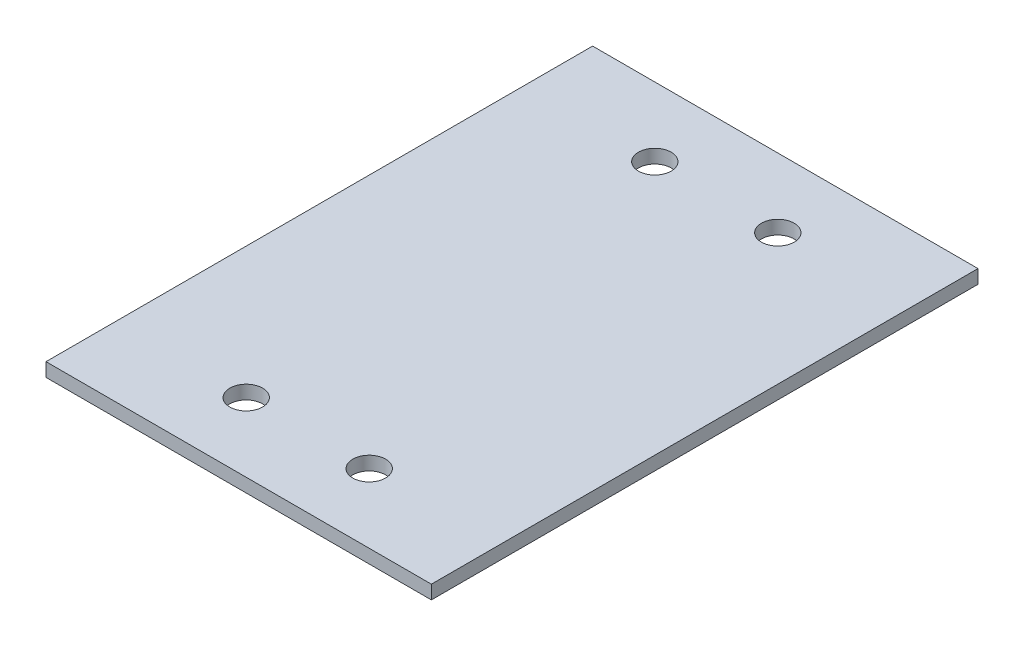
ISO-10303-21;
HEADER;
FILE_DESCRIPTION(('STEP AP214'),'2;1');
FILE_NAME('part.step','',(''),(''),'','','');
FILE_SCHEMA(('AUTOMOTIVE_DESIGN { 1 0 10303 214 1 1 1 1 }'));
ENDSEC;
DATA;
#1=APPLICATION_CONTEXT('core data for automotive mechanical design processes');
#2=APPLICATION_PROTOCOL_DEFINITION('international standard','automotive_design',2000,#1);
#3=PRODUCT_CONTEXT('',#1,'mechanical');
#4=PRODUCT('Part','Part','',(#3));
#5=PRODUCT_RELATED_PRODUCT_CATEGORY('part','',(#4));
#6=PRODUCT_DEFINITION_FORMATION('','',#4);
#7=PRODUCT_DEFINITION_CONTEXT('part definition',#1,'design');
#8=PRODUCT_DEFINITION('design','',#6,#7);
#9=PRODUCT_DEFINITION_SHAPE('','',#8);
#10=(LENGTH_UNIT() NAMED_UNIT(*) SI_UNIT(.MILLI.,.METRE.));
#11=(NAMED_UNIT(*) PLANE_ANGLE_UNIT() SI_UNIT($,.RADIAN.));
#12=(NAMED_UNIT(*) SI_UNIT($,.STERADIAN.) SOLID_ANGLE_UNIT());
#13=UNCERTAINTY_MEASURE_WITH_UNIT(LENGTH_MEASURE(1.E-05),#10,'distance_accuracy_value','');
#14=(GEOMETRIC_REPRESENTATION_CONTEXT(3) GLOBAL_UNCERTAINTY_ASSIGNED_CONTEXT((#13)) GLOBAL_UNIT_ASSIGNED_CONTEXT((#10,
#11,#12)) REPRESENTATION_CONTEXT('',''));
#15=CARTESIAN_POINT('',(0.,0.,0.));
#16=DIRECTION('',(0.,0.,1.));
#17=DIRECTION('',(1.,0.,0.));
#18=AXIS2_PLACEMENT_3D('',#15,#16,#17);
#19=CARTESIAN_POINT('',(0.,5.,0.));
#20=DIRECTION('',(0.,-1.,0.));
#21=DIRECTION('',(0.,0.,-1.));
#22=AXIS2_PLACEMENT_3D('',#19,#20,#21);
#23=PLANE('',#22);
#24=DIRECTION('',(0.,0.,-1.));
#25=VECTOR('',#24,1.);
#26=CARTESIAN_POINT('',(70.5,5.,100.));
#27=LINE('',#26,#25);
#28=CARTESIAN_POINT('',(70.5,5.,100.));
#29=VERTEX_POINT('',#28);
#30=CARTESIAN_POINT('',(70.5,5.,-100.));
#31=VERTEX_POINT('',#30);
#32=EDGE_CURVE('E85',#29,#31,#27,.T.);
#33=ORIENTED_EDGE('',*,*,#32,.T.);
#34=DIRECTION('',(-1.,0.,0.));
#35=VECTOR('',#34,1.);
#36=CARTESIAN_POINT('',(-70.5,5.,-100.));
#37=LINE('',#36,#35);
#38=CARTESIAN_POINT('',(-70.5,5.,-100.));
#39=VERTEX_POINT('',#38);
#40=EDGE_CURVE('E80',#31,#39,#37,.T.);
#41=ORIENTED_EDGE('',*,*,#40,.T.);
#42=DIRECTION('',(0.,0.,1.));
#43=VECTOR('',#42,1.);
#44=CARTESIAN_POINT('',(-70.5,5.,100.));
#45=LINE('',#44,#43);
#46=CARTESIAN_POINT('',(-70.5,5.,100.));
#47=VERTEX_POINT('',#46);
#48=EDGE_CURVE('E83',#39,#47,#45,.T.);
#49=ORIENTED_EDGE('',*,*,#48,.T.);
#50=DIRECTION('',(1.,0.,0.));
#51=VECTOR('',#50,1.);
#52=CARTESIAN_POINT('',(-70.5,5.,100.));
#53=LINE('',#52,#51);
#54=EDGE_CURVE('E50',#47,#29,#53,.T.);
#55=ORIENTED_EDGE('',*,*,#54,.T.);
#56=EDGE_LOOP('',(#33,#41,#49,#55));
#57=FACE_BOUND('',#56,.T.);
#58=CARTESIAN_POINT('',(-22.5,5.,-74.7500000000582));
#59=DIRECTION('',(0.,1.,0.));
#60=DIRECTION('',(0.,0.,1.));
#61=AXIS2_PLACEMENT_3D('',#58,#59,#60);
#62=CIRCLE('',#61,5.99999999999049);
#63=CARTESIAN_POINT('',(-22.5,5.,-68.7500000000677));
#64=VERTEX_POINT('',#63);
#65=EDGE_CURVE('E100',#64,#64,#62,.T.);
#66=ORIENTED_EDGE('',*,*,#65,.F.);
#67=EDGE_LOOP('',(#66));
#68=FACE_BOUND('',#67,.T.);
#69=CARTESIAN_POINT('',(22.5,5.,-74.7500000000582));
#70=DIRECTION('',(0.,1.,0.));
#71=DIRECTION('',(0.,0.,1.));
#72=AXIS2_PLACEMENT_3D('',#69,#70,#71);
#73=CIRCLE('',#72,5.99999999999391);
#74=CARTESIAN_POINT('',(22.5,5.,-68.7500000000643));
#75=VERTEX_POINT('',#74);
#76=EDGE_CURVE('E115',#75,#75,#73,.T.);
#77=ORIENTED_EDGE('',*,*,#76,.F.);
#78=EDGE_LOOP('',(#77));
#79=FACE_BOUND('',#78,.T.);
#80=CARTESIAN_POINT('',(-22.5,5.,74.7499999999418));
#81=DIRECTION('',(0.,1.,0.));
#82=DIRECTION('',(0.,0.,1.));
#83=AXIS2_PLACEMENT_3D('',#80,#81,#82);
#84=CIRCLE('',#83,6.);
#85=CARTESIAN_POINT('',(-22.5,5.,80.7499999999418));
#86=VERTEX_POINT('',#85);
#87=EDGE_CURVE('E121',#86,#86,#84,.T.);
#88=ORIENTED_EDGE('',*,*,#87,.F.);
#89=EDGE_LOOP('',(#88));
#90=FACE_BOUND('',#89,.T.);
#91=CARTESIAN_POINT('',(22.500000000004,5.,74.7499999999418));
#92=DIRECTION('',(0.,1.,0.));
#93=DIRECTION('',(0.,0.,1.));
#94=AXIS2_PLACEMENT_3D('',#91,#92,#93);
#95=CIRCLE('',#94,6.);
#96=CARTESIAN_POINT('',(22.500000000004,5.,80.7499999999418));
#97=VERTEX_POINT('',#96);
#98=EDGE_CURVE('E127',#97,#97,#95,.T.);
#99=ORIENTED_EDGE('',*,*,#98,.F.);
#100=EDGE_LOOP('',(#99));
#101=FACE_BOUND('',#100,.T.);
#102=ADVANCED_FACE('F33',(#57,#68,#79,#90,#101),#23,.F.);
#103=CARTESIAN_POINT('',(0.,0.,0.));
#104=DIRECTION('',(0.,-1.,0.));
#105=DIRECTION('',(0.,0.,-1.));
#106=AXIS2_PLACEMENT_3D('',#103,#104,#105);
#107=PLANE('',#106);
#108=CARTESIAN_POINT('',(-22.5,0.,74.7499999999418));
#109=DIRECTION('',(0.,1.,0.));
#110=DIRECTION('',(0.,0.,1.));
#111=AXIS2_PLACEMENT_3D('',#108,#109,#110);
#112=CIRCLE('',#111,6.);
#113=CARTESIAN_POINT('',(-22.5,0.,80.7499999999418));
#114=VERTEX_POINT('',#113);
#115=EDGE_CURVE('E124',#114,#114,#112,.T.);
#116=ORIENTED_EDGE('',*,*,#115,.T.);
#117=EDGE_LOOP('',(#116));
#118=FACE_BOUND('',#117,.T.);
#119=CARTESIAN_POINT('',(-22.5,0.,-74.7500000000582));
#120=DIRECTION('',(0.,1.,0.));
#121=DIRECTION('',(0.,0.,1.));
#122=AXIS2_PLACEMENT_3D('',#119,#120,#121);
#123=CIRCLE('',#122,5.99999999999049);
#124=CARTESIAN_POINT('',(-22.5,0.,-68.7500000000677));
#125=VERTEX_POINT('',#124);
#126=EDGE_CURVE('E112',#125,#125,#123,.T.);
#127=ORIENTED_EDGE('',*,*,#126,.T.);
#128=EDGE_LOOP('',(#127));
#129=FACE_BOUND('',#128,.T.);
#130=DIRECTION('',(0.,0.,-1.));
#131=VECTOR('',#130,1.);
#132=CARTESIAN_POINT('',(70.5,0.,100.));
#133=LINE('',#132,#131);
#134=CARTESIAN_POINT('',(70.5,0.,100.));
#135=VERTEX_POINT('',#134);
#136=CARTESIAN_POINT('',(70.5,0.,-100.));
#137=VERTEX_POINT('',#136);
#138=EDGE_CURVE('E97',#135,#137,#133,.T.);
#139=ORIENTED_EDGE('',*,*,#138,.F.);
#140=DIRECTION('',(1.,0.,0.));
#141=VECTOR('',#140,1.);
#142=CARTESIAN_POINT('',(-70.5,0.,100.));
#143=LINE('',#142,#141);
#144=CARTESIAN_POINT('',(-70.5,0.,100.));
#145=VERTEX_POINT('',#144);
#146=EDGE_CURVE('E73',#145,#135,#143,.T.);
#147=ORIENTED_EDGE('',*,*,#146,.F.);
#148=DIRECTION('',(0.,0.,1.));
#149=VECTOR('',#148,1.);
#150=CARTESIAN_POINT('',(-70.5,0.,100.));
#151=LINE('',#150,#149);
#152=CARTESIAN_POINT('',(-70.5,0.,-100.));
#153=VERTEX_POINT('',#152);
#154=EDGE_CURVE('E67',#153,#145,#151,.T.);
#155=ORIENTED_EDGE('',*,*,#154,.F.);
#156=DIRECTION('',(-1.,0.,0.));
#157=VECTOR('',#156,1.);
#158=CARTESIAN_POINT('',(-70.5,0.,-100.));
#159=LINE('',#158,#157);
#160=EDGE_CURVE('E89',#137,#153,#159,.T.);
#161=ORIENTED_EDGE('',*,*,#160,.F.);
#162=EDGE_LOOP('',(#139,#147,#155,#161));
#163=FACE_BOUND('',#162,.T.);
#164=CARTESIAN_POINT('',(22.5,0.,-74.7500000000582));
#165=DIRECTION('',(0.,1.,0.));
#166=DIRECTION('',(0.,0.,1.));
#167=AXIS2_PLACEMENT_3D('',#164,#165,#166);
#168=CIRCLE('',#167,5.99999999999391);
#169=CARTESIAN_POINT('',(22.5,0.,-68.7500000000643));
#170=VERTEX_POINT('',#169);
#171=EDGE_CURVE('E118',#170,#170,#168,.T.);
#172=ORIENTED_EDGE('',*,*,#171,.T.);
#173=EDGE_LOOP('',(#172));
#174=FACE_BOUND('',#173,.T.);
#175=CARTESIAN_POINT('',(22.500000000004,0.,74.7499999999418));
#176=DIRECTION('',(0.,1.,0.));
#177=DIRECTION('',(0.,0.,1.));
#178=AXIS2_PLACEMENT_3D('',#175,#176,#177);
#179=CIRCLE('',#178,6.);
#180=CARTESIAN_POINT('',(22.500000000004,0.,80.7499999999418));
#181=VERTEX_POINT('',#180);
#182=EDGE_CURVE('E130',#181,#181,#179,.T.);
#183=ORIENTED_EDGE('',*,*,#182,.T.);
#184=EDGE_LOOP('',(#183));
#185=FACE_BOUND('',#184,.T.);
#186=ADVANCED_FACE('F108',(#118,#129,#163,#174,#185),#107,.T.);
#187=CARTESIAN_POINT('',(70.5,5.,100.));
#188=DIRECTION('',(-1.,0.,0.));
#189=DIRECTION('',(0.,0.,1.));
#190=AXIS2_PLACEMENT_3D('',#187,#188,#189);
#191=PLANE('',#190);
#192=ORIENTED_EDGE('',*,*,#138,.T.);
#193=DIRECTION('',(0.,-1.,0.));
#194=VECTOR('',#193,1.);
#195=CARTESIAN_POINT('',(70.5,5.,-100.));
#196=LINE('',#195,#194);
#197=EDGE_CURVE('E11',#31,#137,#196,.T.);
#198=ORIENTED_EDGE('',*,*,#197,.F.);
#199=ORIENTED_EDGE('',*,*,#32,.F.);
#200=DIRECTION('',(0.,-1.,0.));
#201=VECTOR('',#200,1.);
#202=CARTESIAN_POINT('',(70.5,5.,100.));
#203=LINE('',#202,#201);
#204=EDGE_CURVE('E93',#29,#135,#203,.T.);
#205=ORIENTED_EDGE('',*,*,#204,.T.);
#206=EDGE_LOOP('',(#192,#198,#199,#205));
#207=FACE_BOUND('',#206,.T.);
#208=ADVANCED_FACE('F35',(#207),#191,.F.);
#209=CARTESIAN_POINT('',(-70.5,5.,-100.));
#210=DIRECTION('',(0.,0.,1.));
#211=DIRECTION('',(1.,0.,0.));
#212=AXIS2_PLACEMENT_3D('',#209,#210,#211);
#213=PLANE('',#212);
#214=ORIENTED_EDGE('',*,*,#160,.T.);
#215=DIRECTION('',(0.,-1.,0.));
#216=VECTOR('',#215,1.);
#217=CARTESIAN_POINT('',(-70.5,5.,-100.));
#218=LINE('',#217,#216);
#219=EDGE_CURVE('E42',#39,#153,#218,.T.);
#220=ORIENTED_EDGE('',*,*,#219,.F.);
#221=ORIENTED_EDGE('',*,*,#40,.F.);
#222=ORIENTED_EDGE('',*,*,#197,.T.);
#223=EDGE_LOOP('',(#214,#220,#221,#222));
#224=FACE_BOUND('',#223,.T.);
#225=ADVANCED_FACE('F88',(#224),#213,.F.);
#226=CARTESIAN_POINT('',(-70.5,5.,100.));
#227=DIRECTION('',(1.,0.,0.));
#228=DIRECTION('',(0.,0.,-1.));
#229=AXIS2_PLACEMENT_3D('',#226,#227,#228);
#230=PLANE('',#229);
#231=ORIENTED_EDGE('',*,*,#154,.T.);
#232=DIRECTION('',(0.,-1.,0.));
#233=VECTOR('',#232,1.);
#234=CARTESIAN_POINT('',(-70.5,5.,100.));
#235=LINE('',#234,#233);
#236=EDGE_CURVE('E90',#47,#145,#235,.T.);
#237=ORIENTED_EDGE('',*,*,#236,.F.);
#238=ORIENTED_EDGE('',*,*,#48,.F.);
#239=ORIENTED_EDGE('',*,*,#219,.T.);
#240=EDGE_LOOP('',(#231,#237,#238,#239));
#241=FACE_BOUND('',#240,.T.);
#242=ADVANCED_FACE('F91',(#241),#230,.F.);
#243=CARTESIAN_POINT('',(-70.5,5.,100.));
#244=DIRECTION('',(0.,0.,-1.));
#245=DIRECTION('',(-1.,0.,0.));
#246=AXIS2_PLACEMENT_3D('',#243,#244,#245);
#247=PLANE('',#246);
#248=ORIENTED_EDGE('',*,*,#146,.T.);
#249=ORIENTED_EDGE('',*,*,#204,.F.);
#250=ORIENTED_EDGE('',*,*,#54,.F.);
#251=ORIENTED_EDGE('',*,*,#236,.T.);
#252=EDGE_LOOP('',(#248,#249,#250,#251));
#253=FACE_BOUND('',#252,.T.);
#254=ADVANCED_FACE('F105',(#253),#247,.F.);
#255=CARTESIAN_POINT('',(-22.5,5.,-74.7500000000582));
#256=DIRECTION('',(0.,-1.,0.));
#257=DIRECTION('',(0.,0.,-1.));
#258=AXIS2_PLACEMENT_3D('',#255,#256,#257);
#259=CYLINDRICAL_SURFACE('',#258,5.99999999999049);
#260=ORIENTED_EDGE('',*,*,#65,.T.);
#261=EDGE_LOOP('',(#260));
#262=FACE_BOUND('',#261,.T.);
#263=ORIENTED_EDGE('',*,*,#126,.F.);
#264=EDGE_LOOP('',(#263));
#265=FACE_BOUND('',#264,.T.);
#266=ADVANCED_FACE('F147',(#262,#265),#259,.F.);
#267=CARTESIAN_POINT('',(22.5,5.,-74.7500000000582));
#268=DIRECTION('',(0.,-1.,0.));
#269=DIRECTION('',(0.,0.,-1.));
#270=AXIS2_PLACEMENT_3D('',#267,#268,#269);
#271=CYLINDRICAL_SURFACE('',#270,5.99999999999391);
#272=ORIENTED_EDGE('',*,*,#76,.T.);
#273=EDGE_LOOP('',(#272));
#274=FACE_BOUND('',#273,.T.);
#275=ORIENTED_EDGE('',*,*,#171,.F.);
#276=EDGE_LOOP('',(#275));
#277=FACE_BOUND('',#276,.T.);
#278=ADVANCED_FACE('F193',(#274,#277),#271,.F.);
#279=CARTESIAN_POINT('',(-22.5,5.,74.7499999999418));
#280=DIRECTION('',(0.,-1.,0.));
#281=DIRECTION('',(0.,0.,-1.));
#282=AXIS2_PLACEMENT_3D('',#279,#280,#281);
#283=CYLINDRICAL_SURFACE('',#282,6.);
#284=ORIENTED_EDGE('',*,*,#87,.T.);
#285=EDGE_LOOP('',(#284));
#286=FACE_BOUND('',#285,.T.);
#287=ORIENTED_EDGE('',*,*,#115,.F.);
#288=EDGE_LOOP('',(#287));
#289=FACE_BOUND('',#288,.T.);
#290=ADVANCED_FACE('F201',(#286,#289),#283,.F.);
#291=CARTESIAN_POINT('',(22.500000000004,5.,74.7499999999418));
#292=DIRECTION('',(0.,-1.,0.));
#293=DIRECTION('',(0.,0.,-1.));
#294=AXIS2_PLACEMENT_3D('',#291,#292,#293);
#295=CYLINDRICAL_SURFACE('',#294,6.);
#296=ORIENTED_EDGE('',*,*,#98,.T.);
#297=EDGE_LOOP('',(#296));
#298=FACE_BOUND('',#297,.T.);
#299=ORIENTED_EDGE('',*,*,#182,.F.);
#300=EDGE_LOOP('',(#299));
#301=FACE_BOUND('',#300,.T.);
#302=ADVANCED_FACE('F136',(#298,#301),#295,.F.);
#303=CLOSED_SHELL('',(#102,#186,#208,#225,#242,#254,#266,#278,#290,#302));
#304=MANIFOLD_SOLID_BREP('B2',#303);
#305=ADVANCED_BREP_SHAPE_REPRESENTATION('',(#18,#304),#14);
#306=SHAPE_DEFINITION_REPRESENTATION(#9,#305);
ENDSEC;
END-ISO-10303-21;
